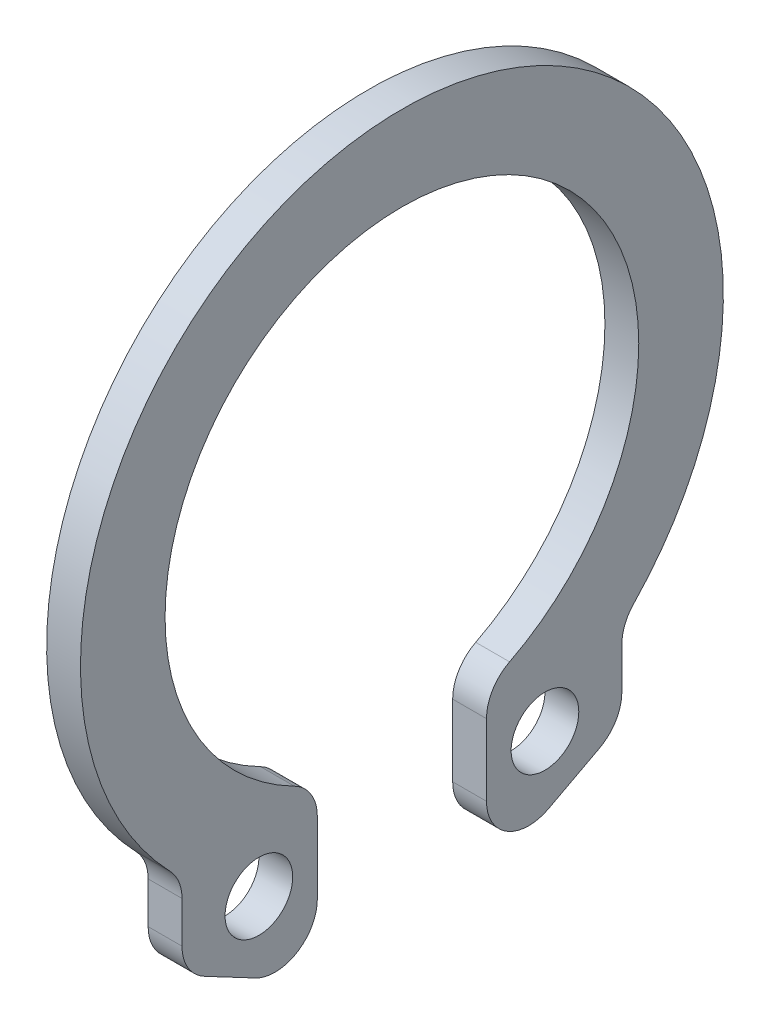
ISO-10303-21;
HEADER;
FILE_DESCRIPTION(('STEP AP214'),'2;1');
FILE_NAME('part.step','',(''),(''),'','','');
FILE_SCHEMA(('AUTOMOTIVE_DESIGN { 1 0 10303 214 1 1 1 1 }'));
ENDSEC;
DATA;
#1=APPLICATION_CONTEXT('core data for automotive mechanical design processes');
#2=APPLICATION_PROTOCOL_DEFINITION('international standard','automotive_design',2000,#1);
#3=PRODUCT_CONTEXT('',#1,'mechanical');
#4=PRODUCT('Part','Part','',(#3));
#5=PRODUCT_RELATED_PRODUCT_CATEGORY('part','',(#4));
#6=PRODUCT_DEFINITION_FORMATION('','',#4);
#7=PRODUCT_DEFINITION_CONTEXT('part definition',#1,'design');
#8=PRODUCT_DEFINITION('design','',#6,#7);
#9=PRODUCT_DEFINITION_SHAPE('','',#8);
#10=(LENGTH_UNIT() NAMED_UNIT(*) SI_UNIT(.MILLI.,.METRE.));
#11=(NAMED_UNIT(*) PLANE_ANGLE_UNIT() SI_UNIT($,.RADIAN.));
#12=(NAMED_UNIT(*) SI_UNIT($,.STERADIAN.) SOLID_ANGLE_UNIT());
#13=UNCERTAINTY_MEASURE_WITH_UNIT(LENGTH_MEASURE(1.E-05),#10,'distance_accuracy_value','');
#14=(GEOMETRIC_REPRESENTATION_CONTEXT(3) GLOBAL_UNCERTAINTY_ASSIGNED_CONTEXT((#13)) GLOBAL_UNIT_ASSIGNED_CONTEXT((#10,
#11,#12)) REPRESENTATION_CONTEXT('',''));
#15=CARTESIAN_POINT('',(0.,0.,0.));
#16=DIRECTION('',(0.,0.,1.));
#17=DIRECTION('',(1.,0.,0.));
#18=AXIS2_PLACEMENT_3D('',#15,#16,#17);
#19=CARTESIAN_POINT('',(0.2,0.,0.));
#20=DIRECTION('',(-1.,0.,0.));
#21=DIRECTION('',(0.,0.,1.));
#22=AXIS2_PLACEMENT_3D('',#19,#20,#21);
#23=PLANE('',#22);
#24=CARTESIAN_POINT('',(0.2,-1.70643443440539,-0.845503359874818));
#25=DIRECTION('',(1.,0.,0.));
#26=DIRECTION('',(0.,0.,-1.));
#27=AXIS2_PLACEMENT_3D('',#24,#25,#26);
#28=CIRCLE('',#27,0.2);
#29=CARTESIAN_POINT('',(0.2,-1.70643443440539,-1.04550335987482));
#30=VERTEX_POINT('',#29);
#31=EDGE_CURVE('E273',#30,#30,#28,.T.);
#32=ORIENTED_EDGE('',*,*,#31,.F.);
#33=EDGE_LOOP('',(#32));
#34=FACE_BOUND('',#33,.T.);
#35=DIRECTION('',(0.,0.467147337537922,-0.884179486886701));
#36=VECTOR('',#35,1.);
#37=CARTESIAN_POINT('',(0.2,-1.88499773062159,-1.3));
#38=LINE('',#37,#36);
#39=CARTESIAN_POINT('',(0.2,-2.1138815487887,-0.866786834384481));
#40=VERTEX_POINT('',#39);
#41=CARTESIAN_POINT('',(0.2,-1.95537956662348,-1.16678683438448));
#42=VERTEX_POINT('',#41);
#43=EDGE_CURVE('E256',#40,#42,#38,.T.);
#44=ORIENTED_EDGE('',*,*,#43,.T.);
#45=CARTESIAN_POINT('',(0.2,-1.7343346949018,-1.05));
#46=DIRECTION('',(-1.,0.,0.));
#47=DIRECTION('',(0.,0.,1.));
#48=AXIS2_PLACEMENT_3D('',#45,#46,#47);
#49=CIRCLE('',#48,0.25);
#50=CARTESIAN_POINT('',(0.2,-1.7343346949018,-1.3));
#51=VERTEX_POINT('',#50);
#52=EDGE_CURVE('E222',#42,#51,#49,.F.);
#53=ORIENTED_EDGE('',*,*,#52,.T.);
#54=DIRECTION('',(0.,1.,0.));
#55=VECTOR('',#54,1.);
#56=CARTESIAN_POINT('',(0.2,-1.3856406460551,-1.3));
#57=LINE('',#56,#55);
#58=CARTESIAN_POINT('',(0.2,-1.48996644257513,-1.3));
#59=VERTEX_POINT('',#58);
#60=EDGE_CURVE('E252',#51,#59,#57,.T.);
#61=ORIENTED_EDGE('',*,*,#60,.T.);
#62=CARTESIAN_POINT('',(0.2,-1.48996644257513,-1.55));
#63=DIRECTION('',(-1.,0.,0.));
#64=DIRECTION('',(0.,0.,1.));
#65=AXIS2_PLACEMENT_3D('',#62,#63,#64);
#66=CIRCLE('',#65,0.25);
#67=CARTESIAN_POINT('',(0.2,-1.31671453064779,-1.36976744186047));
#68=VERTEX_POINT('',#67);
#69=EDGE_CURVE('E159',#59,#68,#66,.T.);
#70=ORIENTED_EDGE('',*,*,#69,.T.);
#71=CARTESIAN_POINT('',(0.2,0.,0.));
#72=DIRECTION('',(1.,0.,0.));
#73=DIRECTION('',(0.,0.,1.));
#74=AXIS2_PLACEMENT_3D('',#71,#72,#73);
#75=CIRCLE('',#74,1.9);
#76=CARTESIAN_POINT('',(0.2,-1.31671453064779,1.36976744186046));
#77=VERTEX_POINT('',#76);
#78=EDGE_CURVE('E169',#68,#77,#75,.T.);
#79=ORIENTED_EDGE('',*,*,#78,.T.);
#80=CARTESIAN_POINT('',(0.2,-1.48996644257513,1.55));
#81=DIRECTION('',(-1.,0.,0.));
#82=DIRECTION('',(0.,0.,1.));
#83=AXIS2_PLACEMENT_3D('',#80,#81,#82);
#84=CIRCLE('',#83,0.25);
#85=CARTESIAN_POINT('',(0.2,-1.48996644257513,1.3));
#86=VERTEX_POINT('',#85);
#87=EDGE_CURVE('E11',#77,#86,#84,.T.);
#88=ORIENTED_EDGE('',*,*,#87,.T.);
#89=DIRECTION('',(0.,-1.,0.));
#90=VECTOR('',#89,1.);
#91=CARTESIAN_POINT('',(0.2,-1.3856406460551,1.3));
#92=LINE('',#91,#90);
#93=CARTESIAN_POINT('',(0.2,-1.7343346949018,1.3));
#94=VERTEX_POINT('',#93);
#95=EDGE_CURVE('E258',#86,#94,#92,.T.);
#96=ORIENTED_EDGE('',*,*,#95,.T.);
#97=CARTESIAN_POINT('',(0.2,-1.7343346949018,1.05));
#98=DIRECTION('',(-1.,0.,0.));
#99=DIRECTION('',(0.,0.,1.));
#100=AXIS2_PLACEMENT_3D('',#97,#98,#99);
#101=CIRCLE('',#100,0.25);
#102=CARTESIAN_POINT('',(0.2,-1.95537956662348,1.16678683438448));
#103=VERTEX_POINT('',#102);
#104=EDGE_CURVE('E216',#94,#103,#101,.F.);
#105=ORIENTED_EDGE('',*,*,#104,.T.);
#106=DIRECTION('',(0.,-0.467147337537922,-0.884179486886702));
#107=VECTOR('',#106,1.);
#108=CARTESIAN_POINT('',(0.2,-1.88499773062159,1.3));
#109=LINE('',#108,#107);
#110=CARTESIAN_POINT('',(0.2,-2.1138815487887,0.86678683438448));
#111=VERTEX_POINT('',#110);
#112=EDGE_CURVE('E266',#103,#111,#109,.T.);
#113=ORIENTED_EDGE('',*,*,#112,.T.);
#114=CARTESIAN_POINT('',(0.2,-1.89283667706703,0.75));
#115=DIRECTION('',(-1.,0.,0.));
#116=DIRECTION('',(0.,0.,1.));
#117=AXIS2_PLACEMENT_3D('',#114,#115,#116);
#118=CIRCLE('',#117,0.25);
#119=CARTESIAN_POINT('',(0.2,-1.89283667706703,0.5));
#120=VERTEX_POINT('',#119);
#121=EDGE_CURVE('E57',#111,#120,#118,.F.);
#122=ORIENTED_EDGE('',*,*,#121,.T.);
#123=DIRECTION('',(0.,1.,0.));
#124=VECTOR('',#123,1.);
#125=CARTESIAN_POINT('',(0.2,-2.3076696830622,0.5));
#126=LINE('',#125,#124);
#127=CARTESIAN_POINT('',(0.2,-1.46969384566991,0.5));
#128=VERTEX_POINT('',#127);
#129=EDGE_CURVE('E191',#120,#128,#126,.T.);
#130=ORIENTED_EDGE('',*,*,#129,.T.);
#131=CARTESIAN_POINT('',(0.2,-1.46969384566991,0.75));
#132=DIRECTION('',(-1.,0.,0.));
#133=DIRECTION('',(0.,0.,1.));
#134=AXIS2_PLACEMENT_3D('',#131,#132,#133);
#135=CIRCLE('',#134,0.25);
#136=CARTESIAN_POINT('',(0.2,-1.24701295996235,0.636363636363636));
#137=VERTEX_POINT('',#136);
#138=EDGE_CURVE('E213',#128,#137,#135,.F.);
#139=ORIENTED_EDGE('',*,*,#138,.T.);
#140=CARTESIAN_POINT('',(0.2,0.,0.));
#141=DIRECTION('',(-1.,0.,0.));
#142=DIRECTION('',(0.,0.,1.));
#143=AXIS2_PLACEMENT_3D('',#140,#141,#142);
#144=CIRCLE('',#143,1.4);
#145=CARTESIAN_POINT('',(0.2,-1.24701295996235,-0.636363636363637));
#146=VERTEX_POINT('',#145);
#147=EDGE_CURVE('E190',#137,#146,#144,.T.);
#148=ORIENTED_EDGE('',*,*,#147,.T.);
#149=CARTESIAN_POINT('',(0.2,-1.46969384566991,-0.75));
#150=DIRECTION('',(-1.,0.,0.));
#151=DIRECTION('',(0.,0.,1.));
#152=AXIS2_PLACEMENT_3D('',#149,#150,#151);
#153=CIRCLE('',#152,0.25);
#154=CARTESIAN_POINT('',(0.2,-1.46969384566991,-0.5));
#155=VERTEX_POINT('',#154);
#156=EDGE_CURVE('E218',#146,#155,#153,.F.);
#157=ORIENTED_EDGE('',*,*,#156,.T.);
#158=DIRECTION('',(0.,-1.,0.));
#159=VECTOR('',#158,1.);
#160=CARTESIAN_POINT('',(0.2,-2.3076696830622,-0.5));
#161=LINE('',#160,#159);
#162=CARTESIAN_POINT('',(0.2,-1.89283667706703,-0.5));
#163=VERTEX_POINT('',#162);
#164=EDGE_CURVE('E260',#155,#163,#161,.T.);
#165=ORIENTED_EDGE('',*,*,#164,.T.);
#166=CARTESIAN_POINT('',(0.2,-1.89283667706703,-0.75));
#167=DIRECTION('',(-1.,0.,0.));
#168=DIRECTION('',(0.,0.,1.));
#169=AXIS2_PLACEMENT_3D('',#166,#167,#168);
#170=CIRCLE('',#169,0.25);
#171=EDGE_CURVE('E220',#163,#40,#170,.F.);
#172=ORIENTED_EDGE('',*,*,#171,.T.);
#173=EDGE_LOOP('',(#44,#53,#61,#70,#79,#88,#96,#105,#113,#122,#130,#139,#148,#157,#165,#172));
#174=FACE_BOUND('',#173,.T.);
#175=CARTESIAN_POINT('',(0.2,-1.70643443440539,0.845503359874818));
#176=DIRECTION('',(1.,0.,0.));
#177=DIRECTION('',(0.,0.,1.));
#178=AXIS2_PLACEMENT_3D('',#175,#176,#177);
#179=CIRCLE('',#178,0.2);
#180=CARTESIAN_POINT('',(0.2,-1.70643443440539,1.04550335987482));
#181=VERTEX_POINT('',#180);
#182=EDGE_CURVE('E365',#181,#181,#179,.T.);
#183=ORIENTED_EDGE('',*,*,#182,.F.);
#184=EDGE_LOOP('',(#183));
#185=FACE_BOUND('',#184,.T.);
#186=ADVANCED_FACE('F35',(#34,#174,#185),#23,.F.);
#187=CARTESIAN_POINT('',(0.,0.,0.));
#188=DIRECTION('',(-1.,0.,0.));
#189=DIRECTION('',(0.,0.,1.));
#190=AXIS2_PLACEMENT_3D('',#187,#188,#189);
#191=PLANE('',#190);
#192=CARTESIAN_POINT('',(0.,-1.70643443440539,-0.845503359874818));
#193=DIRECTION('',(1.,0.,0.));
#194=DIRECTION('',(0.,0.,-1.));
#195=AXIS2_PLACEMENT_3D('',#192,#193,#194);
#196=CIRCLE('',#195,0.2);
#197=CARTESIAN_POINT('',(0.,-1.70643443440539,-1.04550335987482));
#198=VERTEX_POINT('',#197);
#199=EDGE_CURVE('E362',#198,#198,#196,.T.);
#200=ORIENTED_EDGE('',*,*,#199,.T.);
#201=EDGE_LOOP('',(#200));
#202=FACE_BOUND('',#201,.T.);
#203=DIRECTION('',(0.,1.,0.));
#204=VECTOR('',#203,1.);
#205=CARTESIAN_POINT('',(0.,-1.3856406460551,-1.3));
#206=LINE('',#205,#204);
#207=CARTESIAN_POINT('',(0.,-1.7343346949018,-1.3));
#208=VERTEX_POINT('',#207);
#209=CARTESIAN_POINT('',(0.,-1.48996644257513,-1.3));
#210=VERTEX_POINT('',#209);
#211=EDGE_CURVE('E177',#208,#210,#206,.T.);
#212=ORIENTED_EDGE('',*,*,#211,.F.);
#213=CARTESIAN_POINT('',(0.,-1.7343346949018,-1.05));
#214=DIRECTION('',(-1.,0.,0.));
#215=DIRECTION('',(0.,0.,1.));
#216=AXIS2_PLACEMENT_3D('',#213,#214,#215);
#217=CIRCLE('',#216,0.25);
#218=CARTESIAN_POINT('',(0.,-1.95537956662348,-1.16678683438448));
#219=VERTEX_POINT('',#218);
#220=EDGE_CURVE('E206',#208,#219,#217,.T.);
#221=ORIENTED_EDGE('',*,*,#220,.T.);
#222=DIRECTION('',(0.,0.467147337537922,-0.884179486886701));
#223=VECTOR('',#222,1.);
#224=CARTESIAN_POINT('',(0.,-1.88499773062159,-1.3));
#225=LINE('',#224,#223);
#226=CARTESIAN_POINT('',(0.,-2.1138815487887,-0.866786834384481));
#227=VERTEX_POINT('',#226);
#228=EDGE_CURVE('E182',#227,#219,#225,.T.);
#229=ORIENTED_EDGE('',*,*,#228,.F.);
#230=CARTESIAN_POINT('',(0.,-1.89283667706703,-0.75));
#231=DIRECTION('',(-1.,0.,0.));
#232=DIRECTION('',(0.,0.,1.));
#233=AXIS2_PLACEMENT_3D('',#230,#231,#232);
#234=CIRCLE('',#233,0.25);
#235=CARTESIAN_POINT('',(0.,-1.89283667706703,-0.5));
#236=VERTEX_POINT('',#235);
#237=EDGE_CURVE('E204',#227,#236,#234,.T.);
#238=ORIENTED_EDGE('',*,*,#237,.T.);
#239=DIRECTION('',(0.,-1.,0.));
#240=VECTOR('',#239,1.);
#241=CARTESIAN_POINT('',(0.,-2.3076696830622,-0.5));
#242=LINE('',#241,#240);
#243=CARTESIAN_POINT('',(0.,-1.46969384566991,-0.5));
#244=VERTEX_POINT('',#243);
#245=EDGE_CURVE('E272',#244,#236,#242,.T.);
#246=ORIENTED_EDGE('',*,*,#245,.F.);
#247=CARTESIAN_POINT('',(0.,-1.46969384566991,-0.75));
#248=DIRECTION('',(-1.,0.,0.));
#249=DIRECTION('',(0.,0.,1.));
#250=AXIS2_PLACEMENT_3D('',#247,#248,#249);
#251=CIRCLE('',#250,0.25);
#252=CARTESIAN_POINT('',(0.,-1.24701295996235,-0.636363636363637));
#253=VERTEX_POINT('',#252);
#254=EDGE_CURVE('E202',#244,#253,#251,.T.);
#255=ORIENTED_EDGE('',*,*,#254,.T.);
#256=CARTESIAN_POINT('',(0.,0.,0.));
#257=DIRECTION('',(-1.,0.,0.));
#258=DIRECTION('',(0.,0.,1.));
#259=AXIS2_PLACEMENT_3D('',#256,#257,#258);
#260=CIRCLE('',#259,1.4);
#261=CARTESIAN_POINT('',(0.,-1.24701295996235,0.636363636363636));
#262=VERTEX_POINT('',#261);
#263=EDGE_CURVE('E269',#262,#253,#260,.T.);
#264=ORIENTED_EDGE('',*,*,#263,.F.);
#265=CARTESIAN_POINT('',(0.,-1.46969384566991,0.75));
#266=DIRECTION('',(-1.,0.,0.));
#267=DIRECTION('',(0.,0.,1.));
#268=AXIS2_PLACEMENT_3D('',#265,#266,#267);
#269=CIRCLE('',#268,0.25);
#270=CARTESIAN_POINT('',(0.,-1.46969384566991,0.5));
#271=VERTEX_POINT('',#270);
#272=EDGE_CURVE('E196',#262,#271,#269,.T.);
#273=ORIENTED_EDGE('',*,*,#272,.T.);
#274=DIRECTION('',(0.,1.,0.));
#275=VECTOR('',#274,1.);
#276=CARTESIAN_POINT('',(0.,-2.3076696830622,0.5));
#277=LINE('',#276,#275);
#278=CARTESIAN_POINT('',(0.,-1.89283667706703,0.5));
#279=VERTEX_POINT('',#278);
#280=EDGE_CURVE('E188',#279,#271,#277,.T.);
#281=ORIENTED_EDGE('',*,*,#280,.F.);
#282=CARTESIAN_POINT('',(0.,-1.89283667706703,0.75));
#283=DIRECTION('',(-1.,0.,0.));
#284=DIRECTION('',(0.,0.,1.));
#285=AXIS2_PLACEMENT_3D('',#282,#283,#284);
#286=CIRCLE('',#285,0.25);
#287=CARTESIAN_POINT('',(0.,-2.1138815487887,0.86678683438448));
#288=VERTEX_POINT('',#287);
#289=EDGE_CURVE('E198',#279,#288,#286,.T.);
#290=ORIENTED_EDGE('',*,*,#289,.T.);
#291=DIRECTION('',(0.,-0.467147337537922,-0.884179486886702));
#292=VECTOR('',#291,1.);
#293=CARTESIAN_POINT('',(0.,-1.88499773062159,1.3));
#294=LINE('',#293,#292);
#295=CARTESIAN_POINT('',(0.,-1.95537956662348,1.16678683438448));
#296=VERTEX_POINT('',#295);
#297=EDGE_CURVE('E180',#296,#288,#294,.T.);
#298=ORIENTED_EDGE('',*,*,#297,.F.);
#299=CARTESIAN_POINT('',(0.,-1.7343346949018,1.05));
#300=DIRECTION('',(-1.,0.,0.));
#301=DIRECTION('',(0.,0.,1.));
#302=AXIS2_PLACEMENT_3D('',#299,#300,#301);
#303=CIRCLE('',#302,0.25);
#304=CARTESIAN_POINT('',(0.,-1.7343346949018,1.3));
#305=VERTEX_POINT('',#304);
#306=EDGE_CURVE('E200',#296,#305,#303,.T.);
#307=ORIENTED_EDGE('',*,*,#306,.T.);
#308=DIRECTION('',(0.,-1.,0.));
#309=VECTOR('',#308,1.);
#310=CARTESIAN_POINT('',(0.,-1.3856406460551,1.3));
#311=LINE('',#310,#309);
#312=CARTESIAN_POINT('',(0.,-1.48996644257513,1.3));
#313=VERTEX_POINT('',#312);
#314=EDGE_CURVE('E176',#313,#305,#311,.T.);
#315=ORIENTED_EDGE('',*,*,#314,.F.);
#316=CARTESIAN_POINT('',(0.,-1.48996644257513,1.55));
#317=DIRECTION('',(-1.,0.,0.));
#318=DIRECTION('',(0.,0.,1.));
#319=AXIS2_PLACEMENT_3D('',#316,#317,#318);
#320=CIRCLE('',#319,0.25);
#321=CARTESIAN_POINT('',(0.,-1.31671453064779,1.36976744186046));
#322=VERTEX_POINT('',#321);
#323=EDGE_CURVE('E43',#313,#322,#320,.F.);
#324=ORIENTED_EDGE('',*,*,#323,.T.);
#325=CARTESIAN_POINT('',(0.,0.,0.));
#326=DIRECTION('',(1.,0.,0.));
#327=DIRECTION('',(0.,0.,1.));
#328=AXIS2_PLACEMENT_3D('',#325,#326,#327);
#329=CIRCLE('',#328,1.9);
#330=CARTESIAN_POINT('',(0.,-1.31671453064779,-1.36976744186047));
#331=VERTEX_POINT('',#330);
#332=EDGE_CURVE('E166',#331,#322,#329,.T.);
#333=ORIENTED_EDGE('',*,*,#332,.F.);
#334=CARTESIAN_POINT('',(0.,-1.48996644257513,-1.55));
#335=DIRECTION('',(-1.,0.,0.));
#336=DIRECTION('',(0.,0.,1.));
#337=AXIS2_PLACEMENT_3D('',#334,#335,#336);
#338=CIRCLE('',#337,0.25);
#339=EDGE_CURVE('E149',#331,#210,#338,.F.);
#340=ORIENTED_EDGE('',*,*,#339,.T.);
#341=EDGE_LOOP('',(#212,#221,#229,#238,#246,#255,#264,#273,#281,#290,#298,#307,#315,#324,#333,#340));
#342=FACE_BOUND('',#341,.T.);
#343=CARTESIAN_POINT('',(0.,-1.70643443440539,0.845503359874818));
#344=DIRECTION('',(1.,0.,0.));
#345=DIRECTION('',(0.,0.,1.));
#346=AXIS2_PLACEMENT_3D('',#343,#344,#345);
#347=CIRCLE('',#346,0.2);
#348=CARTESIAN_POINT('',(0.,-1.70643443440539,1.04550335987482));
#349=VERTEX_POINT('',#348);
#350=EDGE_CURVE('E368',#349,#349,#347,.T.);
#351=ORIENTED_EDGE('',*,*,#350,.T.);
#352=EDGE_LOOP('',(#351));
#353=FACE_BOUND('',#352,.T.);
#354=ADVANCED_FACE('F173',(#202,#342,#353),#191,.T.);
#355=CARTESIAN_POINT('',(0.2,0.,0.));
#356=DIRECTION('',(-1.,0.,0.));
#357=DIRECTION('',(0.,0.,1.));
#358=AXIS2_PLACEMENT_3D('',#355,#356,#357);
#359=CYLINDRICAL_SURFACE('',#358,1.4);
#360=ORIENTED_EDGE('',*,*,#263,.T.);
#361=DIRECTION('',(-1.,0.,0.));
#362=VECTOR('',#361,1.);
#363=CARTESIAN_POINT('',(0.2,-1.24701295996235,-0.636363636363637));
#364=LINE('',#363,#362);
#365=EDGE_CURVE('E232',#253,#146,#364,.F.);
#366=ORIENTED_EDGE('',*,*,#365,.T.);
#367=ORIENTED_EDGE('',*,*,#147,.F.);
#368=DIRECTION('',(-1.,0.,0.));
#369=VECTOR('',#368,1.);
#370=CARTESIAN_POINT('',(0.2,-1.24701295996235,0.636363636363636));
#371=LINE('',#370,#369);
#372=EDGE_CURVE('E229',#137,#262,#371,.T.);
#373=ORIENTED_EDGE('',*,*,#372,.T.);
#374=EDGE_LOOP('',(#360,#366,#367,#373));
#375=FACE_BOUND('',#374,.T.);
#376=ADVANCED_FACE('F301',(#375),#359,.F.);
#377=CARTESIAN_POINT('',(0.2,-2.3076696830622,-0.5));
#378=DIRECTION('',(0.,0.,-1.));
#379=DIRECTION('',(0.,1.,0.));
#380=AXIS2_PLACEMENT_3D('',#377,#378,#379);
#381=PLANE('',#380);
#382=ORIENTED_EDGE('',*,*,#245,.T.);
#383=DIRECTION('',(-1.,0.,0.));
#384=VECTOR('',#383,1.);
#385=CARTESIAN_POINT('',(0.2,-1.89283667706703,-0.5));
#386=LINE('',#385,#384);
#387=EDGE_CURVE('E227',#236,#163,#386,.F.);
#388=ORIENTED_EDGE('',*,*,#387,.T.);
#389=ORIENTED_EDGE('',*,*,#164,.F.);
#390=DIRECTION('',(-1.,0.,0.));
#391=VECTOR('',#390,1.);
#392=CARTESIAN_POINT('',(0.2,-1.46969384566991,-0.5));
#393=LINE('',#392,#391);
#394=EDGE_CURVE('E224',#155,#244,#393,.T.);
#395=ORIENTED_EDGE('',*,*,#394,.T.);
#396=EDGE_LOOP('',(#382,#388,#389,#395));
#397=FACE_BOUND('',#396,.T.);
#398=ADVANCED_FACE('F293',(#397),#381,.F.);
#399=CARTESIAN_POINT('',(0.2,-1.88499773062159,-1.3));
#400=DIRECTION('',(0.,0.884179486886701,0.467147337537922));
#401=DIRECTION('',(0.,-0.467147337537922,0.884179486886701));
#402=AXIS2_PLACEMENT_3D('',#399,#400,#401);
#403=PLANE('',#402);
#404=ORIENTED_EDGE('',*,*,#228,.T.);
#405=DIRECTION('',(-1.,0.,0.));
#406=VECTOR('',#405,1.);
#407=CARTESIAN_POINT('',(0.2,-1.95537956662348,-1.16678683438448));
#408=LINE('',#407,#406);
#409=EDGE_CURVE('E211',#219,#42,#408,.F.);
#410=ORIENTED_EDGE('',*,*,#409,.T.);
#411=ORIENTED_EDGE('',*,*,#43,.F.);
#412=DIRECTION('',(-1.,0.,0.));
#413=VECTOR('',#412,1.);
#414=CARTESIAN_POINT('',(0.2,-2.1138815487887,-0.866786834384481));
#415=LINE('',#414,#413);
#416=EDGE_CURVE('E208',#40,#227,#415,.T.);
#417=ORIENTED_EDGE('',*,*,#416,.T.);
#418=EDGE_LOOP('',(#404,#410,#411,#417));
#419=FACE_BOUND('',#418,.T.);
#420=ADVANCED_FACE('F279',(#419),#403,.F.);
#421=CARTESIAN_POINT('',(0.2,-1.3856406460551,-1.3));
#422=DIRECTION('',(0.,0.,1.));
#423=DIRECTION('',(1.,0.,0.));
#424=AXIS2_PLACEMENT_3D('',#421,#422,#423);
#425=PLANE('',#424);
#426=ORIENTED_EDGE('',*,*,#211,.T.);
#427=DIRECTION('',(1.,0.,0.));
#428=VECTOR('',#427,1.);
#429=CARTESIAN_POINT('',(0.2,-1.48996644257513,-1.3));
#430=LINE('',#429,#428);
#431=EDGE_CURVE('E154',#210,#59,#430,.T.);
#432=ORIENTED_EDGE('',*,*,#431,.T.);
#433=ORIENTED_EDGE('',*,*,#60,.F.);
#434=DIRECTION('',(-1.,0.,0.));
#435=VECTOR('',#434,1.);
#436=CARTESIAN_POINT('',(0.2,-1.7343346949018,-1.3));
#437=LINE('',#436,#435);
#438=EDGE_CURVE('E170',#51,#208,#437,.T.);
#439=ORIENTED_EDGE('',*,*,#438,.T.);
#440=EDGE_LOOP('',(#426,#432,#433,#439));
#441=FACE_BOUND('',#440,.T.);
#442=ADVANCED_FACE('F284',(#441),#425,.F.);
#443=CARTESIAN_POINT('',(0.2,0.,0.));
#444=DIRECTION('',(-1.,0.,0.));
#445=DIRECTION('',(0.,0.,1.));
#446=AXIS2_PLACEMENT_3D('',#443,#444,#445);
#447=CYLINDRICAL_SURFACE('',#446,1.9);
#448=ORIENTED_EDGE('',*,*,#78,.F.);
#449=DIRECTION('',(-1.,0.,0.));
#450=VECTOR('',#449,1.);
#451=CARTESIAN_POINT('',(0.2,-1.31671453064779,-1.36976744186047));
#452=LINE('',#451,#450);
#453=EDGE_CURVE('E153',#68,#331,#452,.T.);
#454=ORIENTED_EDGE('',*,*,#453,.T.);
#455=ORIENTED_EDGE('',*,*,#332,.T.);
#456=DIRECTION('',(-1.,0.,0.));
#457=VECTOR('',#456,1.);
#458=CARTESIAN_POINT('',(0.2,-1.31671453064779,1.36976744186046));
#459=LINE('',#458,#457);
#460=EDGE_CURVE('E171',#322,#77,#459,.F.);
#461=ORIENTED_EDGE('',*,*,#460,.T.);
#462=EDGE_LOOP('',(#448,#454,#455,#461));
#463=FACE_BOUND('',#462,.T.);
#464=ADVANCED_FACE('F165',(#463),#447,.T.);
#465=CARTESIAN_POINT('',(0.2,-1.3856406460551,1.3));
#466=DIRECTION('',(0.,0.,-1.));
#467=DIRECTION('',(-1.,0.,0.));
#468=AXIS2_PLACEMENT_3D('',#465,#466,#467);
#469=PLANE('',#468);
#470=ORIENTED_EDGE('',*,*,#95,.F.);
#471=DIRECTION('',(1.,0.,0.));
#472=VECTOR('',#471,1.);
#473=CARTESIAN_POINT('',(0.,-1.48996644257513,1.3));
#474=LINE('',#473,#472);
#475=EDGE_CURVE('E236',#86,#313,#474,.F.);
#476=ORIENTED_EDGE('',*,*,#475,.T.);
#477=ORIENTED_EDGE('',*,*,#314,.T.);
#478=DIRECTION('',(-1.,0.,0.));
#479=VECTOR('',#478,1.);
#480=CARTESIAN_POINT('',(0.2,-1.7343346949018,1.3));
#481=LINE('',#480,#479);
#482=EDGE_CURVE('E234',#305,#94,#481,.F.);
#483=ORIENTED_EDGE('',*,*,#482,.T.);
#484=EDGE_LOOP('',(#470,#476,#477,#483));
#485=FACE_BOUND('',#484,.T.);
#486=ADVANCED_FACE('F291',(#485),#469,.F.);
#487=CARTESIAN_POINT('',(0.2,-1.88499773062159,1.3));
#488=DIRECTION('',(0.,0.884179486886702,-0.467147337537922));
#489=DIRECTION('',(0.,0.467147337537922,0.884179486886702));
#490=AXIS2_PLACEMENT_3D('',#487,#488,#489);
#491=PLANE('',#490);
#492=ORIENTED_EDGE('',*,*,#112,.F.);
#493=DIRECTION('',(-1.,0.,0.));
#494=VECTOR('',#493,1.);
#495=CARTESIAN_POINT('',(0.2,-1.95537956662348,1.16678683438448));
#496=LINE('',#495,#494);
#497=EDGE_CURVE('E241',#103,#296,#496,.T.);
#498=ORIENTED_EDGE('',*,*,#497,.T.);
#499=ORIENTED_EDGE('',*,*,#297,.T.);
#500=DIRECTION('',(-1.,0.,0.));
#501=VECTOR('',#500,1.);
#502=CARTESIAN_POINT('',(0.2,-2.1138815487887,0.86678683438448));
#503=LINE('',#502,#501);
#504=EDGE_CURVE('E239',#288,#111,#503,.F.);
#505=ORIENTED_EDGE('',*,*,#504,.T.);
#506=EDGE_LOOP('',(#492,#498,#499,#505));
#507=FACE_BOUND('',#506,.T.);
#508=ADVANCED_FACE('F312',(#507),#491,.F.);
#509=CARTESIAN_POINT('',(0.2,-2.3076696830622,0.5));
#510=DIRECTION('',(0.,0.,1.));
#511=DIRECTION('',(0.,-1.,0.));
#512=AXIS2_PLACEMENT_3D('',#509,#510,#511);
#513=PLANE('',#512);
#514=ORIENTED_EDGE('',*,*,#129,.F.);
#515=DIRECTION('',(-1.,0.,0.));
#516=VECTOR('',#515,1.);
#517=CARTESIAN_POINT('',(0.2,-1.89283667706703,0.5));
#518=LINE('',#517,#516);
#519=EDGE_CURVE('E160',#120,#279,#518,.T.);
#520=ORIENTED_EDGE('',*,*,#519,.T.);
#521=ORIENTED_EDGE('',*,*,#280,.T.);
#522=DIRECTION('',(-1.,0.,0.));
#523=VECTOR('',#522,1.);
#524=CARTESIAN_POINT('',(0.2,-1.46969384566991,0.5));
#525=LINE('',#524,#523);
#526=EDGE_CURVE('E50',#271,#128,#525,.F.);
#527=ORIENTED_EDGE('',*,*,#526,.T.);
#528=EDGE_LOOP('',(#514,#520,#521,#527));
#529=FACE_BOUND('',#528,.T.);
#530=ADVANCED_FACE('F309',(#529),#513,.F.);
#531=CARTESIAN_POINT('',(0.2,-1.70643443440539,-0.845503359874818));
#532=DIRECTION('',(-1.,0.,0.));
#533=DIRECTION('',(0.,0.,1.));
#534=AXIS2_PLACEMENT_3D('',#531,#532,#533);
#535=CYLINDRICAL_SURFACE('',#534,0.2);
#536=ORIENTED_EDGE('',*,*,#31,.T.);
#537=EDGE_LOOP('',(#536));
#538=FACE_BOUND('',#537,.T.);
#539=ORIENTED_EDGE('',*,*,#199,.F.);
#540=EDGE_LOOP('',(#539));
#541=FACE_BOUND('',#540,.T.);
#542=ADVANCED_FACE('F306',(#538,#541),#535,.F.);
#543=CARTESIAN_POINT('',(0.2,-1.70643443440539,0.845503359874818));
#544=DIRECTION('',(-1.,0.,0.));
#545=DIRECTION('',(0.,0.,1.));
#546=AXIS2_PLACEMENT_3D('',#543,#544,#545);
#547=CYLINDRICAL_SURFACE('',#546,0.2);
#548=ORIENTED_EDGE('',*,*,#182,.T.);
#549=EDGE_LOOP('',(#548));
#550=FACE_BOUND('',#549,.T.);
#551=ORIENTED_EDGE('',*,*,#350,.F.);
#552=EDGE_LOOP('',(#551));
#553=FACE_BOUND('',#552,.T.);
#554=ADVANCED_FACE('F374',(#550,#553),#547,.F.);
#555=CARTESIAN_POINT('',(0.2,-1.48996644257513,-1.55));
#556=DIRECTION('',(-1.,0.,0.));
#557=DIRECTION('',(0.,0.,1.));
#558=AXIS2_PLACEMENT_3D('',#555,#556,#557);
#559=CYLINDRICAL_SURFACE('',#558,0.25);
#560=ORIENTED_EDGE('',*,*,#69,.F.);
#561=ORIENTED_EDGE('',*,*,#431,.F.);
#562=ORIENTED_EDGE('',*,*,#339,.F.);
#563=ORIENTED_EDGE('',*,*,#453,.F.);
#564=EDGE_LOOP('',(#560,#561,#562,#563));
#565=FACE_BOUND('',#564,.T.);
#566=ADVANCED_FACE('F152',(#565),#559,.F.);
#567=CARTESIAN_POINT('',(0.2,-1.7343346949018,-1.05));
#568=DIRECTION('',(-1.,0.,0.));
#569=DIRECTION('',(0.,0.,1.));
#570=AXIS2_PLACEMENT_3D('',#567,#568,#569);
#571=CYLINDRICAL_SURFACE('',#570,0.25);
#572=ORIENTED_EDGE('',*,*,#52,.F.);
#573=ORIENTED_EDGE('',*,*,#409,.F.);
#574=ORIENTED_EDGE('',*,*,#220,.F.);
#575=ORIENTED_EDGE('',*,*,#438,.F.);
#576=EDGE_LOOP('',(#572,#573,#574,#575));
#577=FACE_BOUND('',#576,.T.);
#578=ADVANCED_FACE('F283',(#577),#571,.T.);
#579=CARTESIAN_POINT('',(0.2,-1.89283667706703,-0.75));
#580=DIRECTION('',(-1.,0.,0.));
#581=DIRECTION('',(0.,0.,1.));
#582=AXIS2_PLACEMENT_3D('',#579,#580,#581);
#583=CYLINDRICAL_SURFACE('',#582,0.25);
#584=ORIENTED_EDGE('',*,*,#171,.F.);
#585=ORIENTED_EDGE('',*,*,#387,.F.);
#586=ORIENTED_EDGE('',*,*,#237,.F.);
#587=ORIENTED_EDGE('',*,*,#416,.F.);
#588=EDGE_LOOP('',(#584,#585,#586,#587));
#589=FACE_BOUND('',#588,.T.);
#590=ADVANCED_FACE('F337',(#589),#583,.T.);
#591=CARTESIAN_POINT('',(0.2,-1.46969384566991,-0.75));
#592=DIRECTION('',(-1.,0.,0.));
#593=DIRECTION('',(0.,0.,1.));
#594=AXIS2_PLACEMENT_3D('',#591,#592,#593);
#595=CYLINDRICAL_SURFACE('',#594,0.25);
#596=ORIENTED_EDGE('',*,*,#156,.F.);
#597=ORIENTED_EDGE('',*,*,#365,.F.);
#598=ORIENTED_EDGE('',*,*,#254,.F.);
#599=ORIENTED_EDGE('',*,*,#394,.F.);
#600=EDGE_LOOP('',(#596,#597,#598,#599));
#601=FACE_BOUND('',#600,.T.);
#602=ADVANCED_FACE('F328',(#601),#595,.T.);
#603=CARTESIAN_POINT('',(0.2,-1.48996644257513,1.55));
#604=DIRECTION('',(-1.,0.,0.));
#605=DIRECTION('',(0.,0.,1.));
#606=AXIS2_PLACEMENT_3D('',#603,#604,#605);
#607=CYLINDRICAL_SURFACE('',#606,0.25);
#608=ORIENTED_EDGE('',*,*,#87,.F.);
#609=ORIENTED_EDGE('',*,*,#460,.F.);
#610=ORIENTED_EDGE('',*,*,#323,.F.);
#611=ORIENTED_EDGE('',*,*,#475,.F.);
#612=EDGE_LOOP('',(#608,#609,#610,#611));
#613=FACE_BOUND('',#612,.T.);
#614=ADVANCED_FACE('F325',(#613),#607,.F.);
#615=CARTESIAN_POINT('',(0.2,-1.7343346949018,1.05));
#616=DIRECTION('',(-1.,0.,0.));
#617=DIRECTION('',(0.,0.,1.));
#618=AXIS2_PLACEMENT_3D('',#615,#616,#617);
#619=CYLINDRICAL_SURFACE('',#618,0.25);
#620=ORIENTED_EDGE('',*,*,#104,.F.);
#621=ORIENTED_EDGE('',*,*,#482,.F.);
#622=ORIENTED_EDGE('',*,*,#306,.F.);
#623=ORIENTED_EDGE('',*,*,#497,.F.);
#624=EDGE_LOOP('',(#620,#621,#622,#623));
#625=FACE_BOUND('',#624,.T.);
#626=ADVANCED_FACE('F327',(#625),#619,.T.);
#627=CARTESIAN_POINT('',(0.2,-1.89283667706703,0.75));
#628=DIRECTION('',(-1.,0.,0.));
#629=DIRECTION('',(0.,0.,1.));
#630=AXIS2_PLACEMENT_3D('',#627,#628,#629);
#631=CYLINDRICAL_SURFACE('',#630,0.25);
#632=ORIENTED_EDGE('',*,*,#121,.F.);
#633=ORIENTED_EDGE('',*,*,#504,.F.);
#634=ORIENTED_EDGE('',*,*,#289,.F.);
#635=ORIENTED_EDGE('',*,*,#519,.F.);
#636=EDGE_LOOP('',(#632,#633,#634,#635));
#637=FACE_BOUND('',#636,.T.);
#638=ADVANCED_FACE('F334',(#637),#631,.T.);
#639=CARTESIAN_POINT('',(0.2,-1.46969384566991,0.75));
#640=DIRECTION('',(-1.,0.,0.));
#641=DIRECTION('',(0.,0.,1.));
#642=AXIS2_PLACEMENT_3D('',#639,#640,#641);
#643=CYLINDRICAL_SURFACE('',#642,0.25);
#644=ORIENTED_EDGE('',*,*,#138,.F.);
#645=ORIENTED_EDGE('',*,*,#526,.F.);
#646=ORIENTED_EDGE('',*,*,#272,.F.);
#647=ORIENTED_EDGE('',*,*,#372,.F.);
#648=EDGE_LOOP('',(#644,#645,#646,#647));
#649=FACE_BOUND('',#648,.T.);
#650=ADVANCED_FACE('F37',(#649),#643,.T.);
#651=CLOSED_SHELL('',(#186,#354,#376,#398,#420,#442,#464,#486,#508,#530,#542,#554,#566,#578,
#590,#602,#614,#626,#638,#650));
#652=MANIFOLD_SOLID_BREP('B2',#651);
#653=ADVANCED_BREP_SHAPE_REPRESENTATION('',(#18,#652),#14);
#654=SHAPE_DEFINITION_REPRESENTATION(#9,#653);
ENDSEC;
END-ISO-10303-21;
